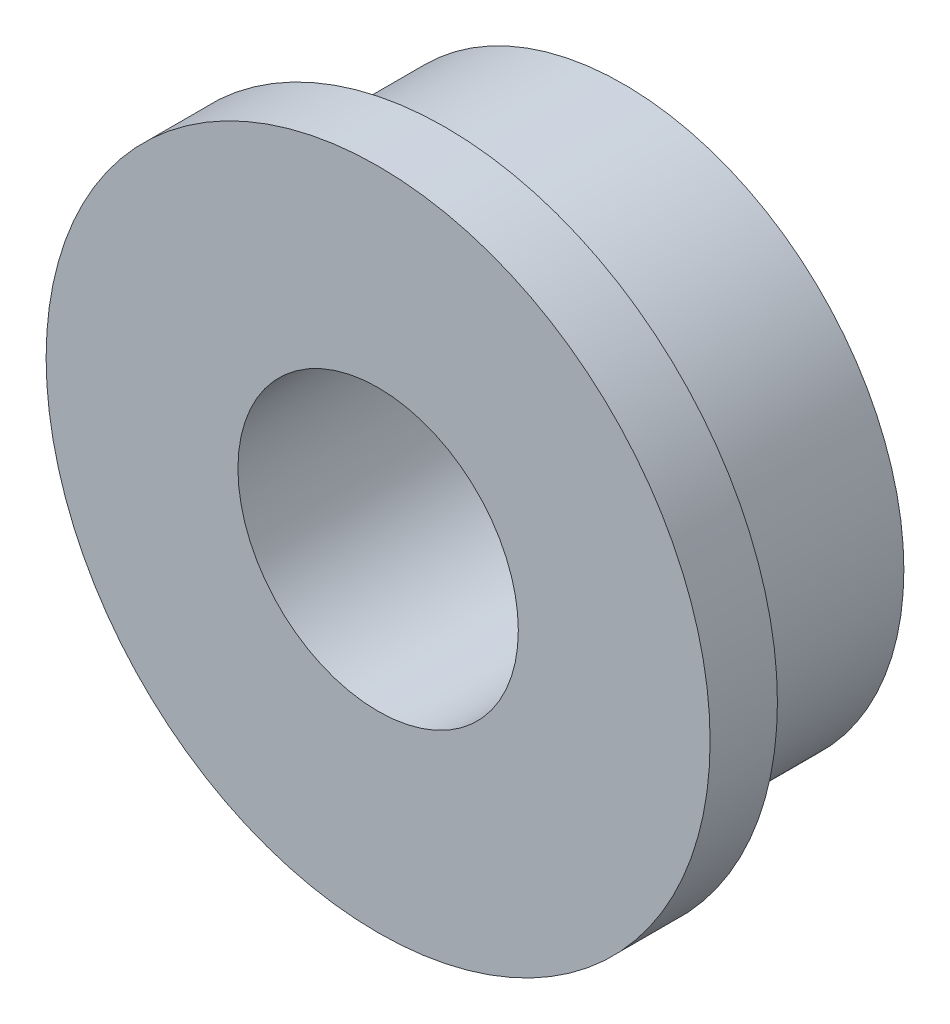
ISO-10303-21;
HEADER;
FILE_DESCRIPTION(('STEP AP214'),'2;1');
FILE_NAME('part.step','',(''),(''),'','','');
FILE_SCHEMA(('AUTOMOTIVE_DESIGN { 1 0 10303 214 1 1 1 1 }'));
ENDSEC;
DATA;
#1=APPLICATION_CONTEXT('core data for automotive mechanical design processes');
#2=APPLICATION_PROTOCOL_DEFINITION('international standard','automotive_design',2000,#1);
#3=PRODUCT_CONTEXT('',#1,'mechanical');
#4=PRODUCT('Part','Part','',(#3));
#5=PRODUCT_RELATED_PRODUCT_CATEGORY('part','',(#4));
#6=PRODUCT_DEFINITION_FORMATION('','',#4);
#7=PRODUCT_DEFINITION_CONTEXT('part definition',#1,'design');
#8=PRODUCT_DEFINITION('design','',#6,#7);
#9=PRODUCT_DEFINITION_SHAPE('','',#8);
#10=(LENGTH_UNIT() NAMED_UNIT(*) SI_UNIT(.MILLI.,.METRE.));
#11=(NAMED_UNIT(*) PLANE_ANGLE_UNIT() SI_UNIT($,.RADIAN.));
#12=(NAMED_UNIT(*) SI_UNIT($,.STERADIAN.) SOLID_ANGLE_UNIT());
#13=UNCERTAINTY_MEASURE_WITH_UNIT(LENGTH_MEASURE(1.E-05),#10,'distance_accuracy_value','');
#14=(GEOMETRIC_REPRESENTATION_CONTEXT(3) GLOBAL_UNCERTAINTY_ASSIGNED_CONTEXT((#13)) GLOBAL_UNIT_ASSIGNED_CONTEXT((#10,
#11,#12)) REPRESENTATION_CONTEXT('',''));
#15=CARTESIAN_POINT('',(0.,0.,0.));
#16=DIRECTION('',(0.,0.,1.));
#17=DIRECTION('',(1.,0.,0.));
#18=AXIS2_PLACEMENT_3D('',#15,#16,#17);
#19=CARTESIAN_POINT('',(0.,0.,0.));
#20=DIRECTION('',(0.,0.,1.));
#21=DIRECTION('',(1.,0.,0.));
#22=AXIS2_PLACEMENT_3D('',#19,#20,#21);
#23=PLANE('',#22);
#24=CARTESIAN_POINT('',(0.,0.,0.));
#25=DIRECTION('',(0.,0.,1.));
#26=DIRECTION('',(1.,0.,0.));
#27=AXIS2_PLACEMENT_3D('',#24,#25,#26);
#28=CIRCLE('',#27,3.175);
#29=CARTESIAN_POINT('',(3.175,0.,0.));
#30=VERTEX_POINT('',#29);
#31=EDGE_CURVE('E37',#30,#30,#28,.T.);
#32=ORIENTED_EDGE('',*,*,#31,.F.);
#33=EDGE_LOOP('',(#32));
#34=FACE_BOUND('',#33,.T.);
#35=CARTESIAN_POINT('',(0.,0.,0.));
#36=DIRECTION('',(0.,0.,1.));
#37=DIRECTION('',(1.,0.,0.));
#38=AXIS2_PLACEMENT_3D('',#35,#36,#37);
#39=CIRCLE('',#38,1.5875);
#40=CARTESIAN_POINT('',(1.5875,0.,0.));
#41=VERTEX_POINT('',#40);
#42=EDGE_CURVE('E44',#41,#41,#39,.T.);
#43=ORIENTED_EDGE('',*,*,#42,.T.);
#44=EDGE_LOOP('',(#43));
#45=FACE_BOUND('',#44,.T.);
#46=ADVANCED_FACE('F33',(#34,#45),#23,.F.);
#47=CARTESIAN_POINT('',(0.,0.,2.016125));
#48=DIRECTION('',(0.,0.,-1.));
#49=DIRECTION('',(-1.,0.,0.));
#50=AXIS2_PLACEMENT_3D('',#47,#48,#49);
#51=CYLINDRICAL_SURFACE('',#50,3.175);
#52=CARTESIAN_POINT('',(0.,0.,2.016125));
#53=DIRECTION('',(0.,0.,1.));
#54=DIRECTION('',(1.,0.,0.));
#55=AXIS2_PLACEMENT_3D('',#52,#53,#54);
#56=CIRCLE('',#55,3.175);
#57=CARTESIAN_POINT('',(3.175,0.,2.016125));
#58=VERTEX_POINT('',#57);
#59=EDGE_CURVE('E10',#58,#58,#56,.T.);
#60=ORIENTED_EDGE('',*,*,#59,.F.);
#61=EDGE_LOOP('',(#60));
#62=FACE_BOUND('',#61,.T.);
#63=ORIENTED_EDGE('',*,*,#31,.T.);
#64=EDGE_LOOP('',(#63));
#65=FACE_BOUND('',#64,.T.);
#66=ADVANCED_FACE('F35',(#62,#65),#51,.T.);
#67=CARTESIAN_POINT('',(0.,0.,2.016125));
#68=DIRECTION('',(0.,0.,-1.));
#69=DIRECTION('',(-1.,0.,0.));
#70=AXIS2_PLACEMENT_3D('',#67,#68,#69);
#71=CYLINDRICAL_SURFACE('',#70,1.5875);
#72=ORIENTED_EDGE('',*,*,#42,.F.);
#73=EDGE_LOOP('',(#72));
#74=FACE_BOUND('',#73,.T.);
#75=CARTESIAN_POINT('',(0.,0.,2.778125));
#76=DIRECTION('',(0.,0.,1.));
#77=DIRECTION('',(1.,0.,0.));
#78=AXIS2_PLACEMENT_3D('',#75,#76,#77);
#79=CIRCLE('',#78,1.5875);
#80=CARTESIAN_POINT('',(1.5875,0.,2.778125));
#81=VERTEX_POINT('',#80);
#82=EDGE_CURVE('E52',#81,#81,#79,.T.);
#83=ORIENTED_EDGE('',*,*,#82,.T.);
#84=EDGE_LOOP('',(#83));
#85=FACE_BOUND('',#84,.T.);
#86=ADVANCED_FACE('F58',(#74,#85),#71,.F.);
#87=CARTESIAN_POINT('',(0.,0.,2.016125));
#88=DIRECTION('',(0.,0.,1.));
#89=DIRECTION('',(1.,0.,0.));
#90=AXIS2_PLACEMENT_3D('',#87,#88,#89);
#91=PLANE('',#90);
#92=CARTESIAN_POINT('',(0.,0.,2.016125));
#93=DIRECTION('',(0.,0.,1.));
#94=DIRECTION('',(1.,0.,0.));
#95=AXIS2_PLACEMENT_3D('',#92,#93,#94);
#96=CIRCLE('',#95,3.7592);
#97=CARTESIAN_POINT('',(3.7592,0.,2.016125));
#98=VERTEX_POINT('',#97);
#99=EDGE_CURVE('E49',#98,#98,#96,.T.);
#100=ORIENTED_EDGE('',*,*,#99,.F.);
#101=EDGE_LOOP('',(#100));
#102=FACE_BOUND('',#101,.T.);
#103=ORIENTED_EDGE('',*,*,#59,.T.);
#104=EDGE_LOOP('',(#103));
#105=FACE_BOUND('',#104,.T.);
#106=ADVANCED_FACE('F63',(#102,#105),#91,.F.);
#107=CARTESIAN_POINT('',(0.,0.,2.778125));
#108=DIRECTION('',(0.,0.,1.));
#109=DIRECTION('',(1.,0.,0.));
#110=AXIS2_PLACEMENT_3D('',#107,#108,#109);
#111=PLANE('',#110);
#112=CARTESIAN_POINT('',(0.,0.,2.778125));
#113=DIRECTION('',(0.,0.,1.));
#114=DIRECTION('',(1.,0.,0.));
#115=AXIS2_PLACEMENT_3D('',#112,#113,#114);
#116=CIRCLE('',#115,3.7592);
#117=CARTESIAN_POINT('',(3.7592,0.,2.778125));
#118=VERTEX_POINT('',#117);
#119=EDGE_CURVE('E48',#118,#118,#116,.T.);
#120=ORIENTED_EDGE('',*,*,#119,.T.);
#121=EDGE_LOOP('',(#120));
#122=FACE_BOUND('',#121,.T.);
#123=ORIENTED_EDGE('',*,*,#82,.F.);
#124=EDGE_LOOP('',(#123));
#125=FACE_BOUND('',#124,.T.);
#126=ADVANCED_FACE('F60',(#122,#125),#111,.T.);
#127=CARTESIAN_POINT('',(0.,0.,2.778125));
#128=DIRECTION('',(0.,0.,-1.));
#129=DIRECTION('',(-1.,0.,0.));
#130=AXIS2_PLACEMENT_3D('',#127,#128,#129);
#131=CYLINDRICAL_SURFACE('',#130,3.7592);
#132=ORIENTED_EDGE('',*,*,#119,.F.);
#133=EDGE_LOOP('',(#132));
#134=FACE_BOUND('',#133,.T.);
#135=ORIENTED_EDGE('',*,*,#99,.T.);
#136=EDGE_LOOP('',(#135));
#137=FACE_BOUND('',#136,.T.);
#138=ADVANCED_FACE('F62',(#134,#137),#131,.T.);
#139=CLOSED_SHELL('',(#46,#66,#86,#106,#126,#138));
#140=MANIFOLD_SOLID_BREP('B2',#139);
#141=ADVANCED_BREP_SHAPE_REPRESENTATION('',(#18,#140),#14);
#142=SHAPE_DEFINITION_REPRESENTATION(#9,#141);
ENDSEC;
END-ISO-10303-21;
